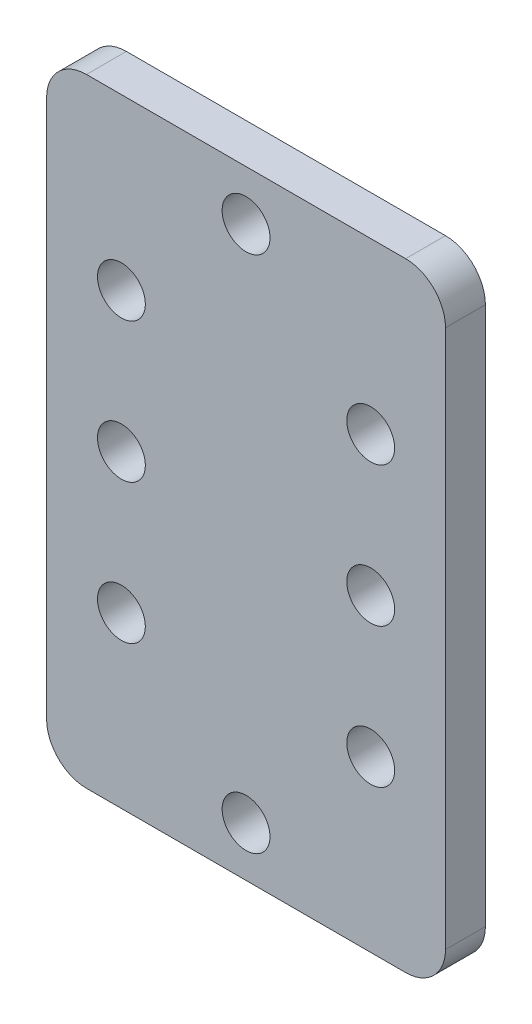
ISO-10303-21;
HEADER;
FILE_DESCRIPTION(('STEP AP214'),'2;1');
FILE_NAME('part.step','',(''),(''),'','','');
FILE_SCHEMA(('AUTOMOTIVE_DESIGN { 1 0 10303 214 1 1 1 1 }'));
ENDSEC;
DATA;
#1=APPLICATION_CONTEXT('core data for automotive mechanical design processes');
#2=APPLICATION_PROTOCOL_DEFINITION('international standard','automotive_design',2000,#1);
#3=PRODUCT_CONTEXT('',#1,'mechanical');
#4=PRODUCT('Part','Part','',(#3));
#5=PRODUCT_RELATED_PRODUCT_CATEGORY('part','',(#4));
#6=PRODUCT_DEFINITION_FORMATION('','',#4);
#7=PRODUCT_DEFINITION_CONTEXT('part definition',#1,'design');
#8=PRODUCT_DEFINITION('design','',#6,#7);
#9=PRODUCT_DEFINITION_SHAPE('','',#8);
#10=(LENGTH_UNIT() NAMED_UNIT(*) SI_UNIT(.MILLI.,.METRE.));
#11=(NAMED_UNIT(*) PLANE_ANGLE_UNIT() SI_UNIT($,.RADIAN.));
#12=(NAMED_UNIT(*) SI_UNIT($,.STERADIAN.) SOLID_ANGLE_UNIT());
#13=UNCERTAINTY_MEASURE_WITH_UNIT(LENGTH_MEASURE(1.E-05),#10,'distance_accuracy_value','');
#14=(GEOMETRIC_REPRESENTATION_CONTEXT(3) GLOBAL_UNCERTAINTY_ASSIGNED_CONTEXT((#13)) GLOBAL_UNIT_ASSIGNED_CONTEXT((#10,
#11,#12)) REPRESENTATION_CONTEXT('',''));
#15=CARTESIAN_POINT('',(0.,0.,0.));
#16=DIRECTION('',(0.,0.,1.));
#17=DIRECTION('',(1.,0.,0.));
#18=AXIS2_PLACEMENT_3D('',#15,#16,#17);
#19=CARTESIAN_POINT('',(0.,0.,2.54));
#20=DIRECTION('',(0.,0.,1.));
#21=DIRECTION('',(1.,0.,0.));
#22=AXIS2_PLACEMENT_3D('',#19,#20,#21);
#23=PLANE('',#22);
#24=CARTESIAN_POINT('',(12.7,-3.175,2.54));
#25=DIRECTION('',(0.,0.,1.));
#26=DIRECTION('',(1.,0.,0.));
#27=AXIS2_PLACEMENT_3D('',#24,#25,#26);
#28=CIRCLE('',#27,1.524);
#29=CARTESIAN_POINT('',(14.224,-3.175,2.54));
#30=VERTEX_POINT('',#29);
#31=EDGE_CURVE('E215',#30,#30,#28,.T.);
#32=ORIENTED_EDGE('',*,*,#31,.F.);
#33=EDGE_LOOP('',(#32));
#34=FACE_BOUND('',#33,.T.);
#35=CARTESIAN_POINT('',(4.76250000000009,-28.575,2.54));
#36=DIRECTION('',(0.,0.,1.));
#37=DIRECTION('',(1.,0.,0.));
#38=AXIS2_PLACEMENT_3D('',#35,#36,#37);
#39=CIRCLE('',#38,1.524);
#40=CARTESIAN_POINT('',(6.28650000000009,-28.575,2.54));
#41=VERTEX_POINT('',#40);
#42=EDGE_CURVE('E203',#41,#41,#39,.T.);
#43=ORIENTED_EDGE('',*,*,#42,.F.);
#44=EDGE_LOOP('',(#43));
#45=FACE_BOUND('',#44,.T.);
#46=CARTESIAN_POINT('',(4.76249999999997,-10.795,2.54));
#47=DIRECTION('',(0.,0.,1.));
#48=DIRECTION('',(1.,0.,0.));
#49=AXIS2_PLACEMENT_3D('',#46,#47,#48);
#50=CIRCLE('',#49,1.524);
#51=CARTESIAN_POINT('',(6.28649999999997,-10.795,2.54));
#52=VERTEX_POINT('',#51);
#53=EDGE_CURVE('E191',#52,#52,#50,.T.);
#54=ORIENTED_EDGE('',*,*,#53,.F.);
#55=EDGE_LOOP('',(#54));
#56=FACE_BOUND('',#55,.T.);
#57=CARTESIAN_POINT('',(4.7625,-19.685,2.54));
#58=DIRECTION('',(0.,0.,1.));
#59=DIRECTION('',(1.,0.,0.));
#60=AXIS2_PLACEMENT_3D('',#57,#58,#59);
#61=CIRCLE('',#60,1.524);
#62=CARTESIAN_POINT('',(6.2865,-19.685,2.54));
#63=VERTEX_POINT('',#62);
#64=EDGE_CURVE('E174',#63,#63,#61,.T.);
#65=ORIENTED_EDGE('',*,*,#64,.F.);
#66=EDGE_LOOP('',(#65));
#67=FACE_BOUND('',#66,.T.);
#68=DIRECTION('',(1.,0.,0.));
#69=VECTOR('',#68,1.);
#70=CARTESIAN_POINT('',(0.,-39.37,2.54));
#71=LINE('',#70,#69);
#72=CARTESIAN_POINT('',(2.54000000000001,-39.37,2.54));
#73=VERTEX_POINT('',#72);
#74=CARTESIAN_POINT('',(22.86,-39.37,2.54));
#75=VERTEX_POINT('',#74);
#76=EDGE_CURVE('E181',#73,#75,#71,.T.);
#77=ORIENTED_EDGE('',*,*,#76,.T.);
#78=CARTESIAN_POINT('',(22.86,-36.83,2.54));
#79=DIRECTION('',(0.,0.,1.));
#80=DIRECTION('',(1.,0.,0.));
#81=AXIS2_PLACEMENT_3D('',#78,#79,#80);
#82=CIRCLE('',#81,2.54);
#83=CARTESIAN_POINT('',(25.4,-36.83,2.54));
#84=VERTEX_POINT('',#83);
#85=EDGE_CURVE('E158',#75,#84,#82,.T.);
#86=ORIENTED_EDGE('',*,*,#85,.T.);
#87=DIRECTION('',(0.,1.,0.));
#88=VECTOR('',#87,1.);
#89=CARTESIAN_POINT('',(25.4,0.,2.54));
#90=LINE('',#89,#88);
#91=CARTESIAN_POINT('',(25.4,-2.54,2.54));
#92=VERTEX_POINT('',#91);
#93=EDGE_CURVE('E128',#84,#92,#90,.T.);
#94=ORIENTED_EDGE('',*,*,#93,.T.);
#95=CARTESIAN_POINT('',(22.86,-2.54,2.54));
#96=DIRECTION('',(0.,0.,1.));
#97=DIRECTION('',(1.,0.,0.));
#98=AXIS2_PLACEMENT_3D('',#95,#96,#97);
#99=CIRCLE('',#98,2.54);
#100=CARTESIAN_POINT('',(22.86,0.,2.54));
#101=VERTEX_POINT('',#100);
#102=EDGE_CURVE('E65',#92,#101,#99,.T.);
#103=ORIENTED_EDGE('',*,*,#102,.T.);
#104=DIRECTION('',(-1.,0.,0.));
#105=VECTOR('',#104,1.);
#106=CARTESIAN_POINT('',(0.,0.,2.54));
#107=LINE('',#106,#105);
#108=CARTESIAN_POINT('',(2.54,0.,2.54));
#109=VERTEX_POINT('',#108);
#110=EDGE_CURVE('E144',#101,#109,#107,.T.);
#111=ORIENTED_EDGE('',*,*,#110,.T.);
#112=CARTESIAN_POINT('',(2.54,-2.54,2.54));
#113=DIRECTION('',(0.,0.,1.));
#114=DIRECTION('',(1.,0.,0.));
#115=AXIS2_PLACEMENT_3D('',#112,#113,#114);
#116=CIRCLE('',#115,2.54);
#117=CARTESIAN_POINT('',(0.,-2.54,2.54));
#118=VERTEX_POINT('',#117);
#119=EDGE_CURVE('E153',#109,#118,#116,.T.);
#120=ORIENTED_EDGE('',*,*,#119,.T.);
#121=DIRECTION('',(0.,-1.,0.));
#122=VECTOR('',#121,1.);
#123=CARTESIAN_POINT('',(0.,0.,2.54));
#124=LINE('',#123,#122);
#125=CARTESIAN_POINT('',(0.,-36.83,2.54));
#126=VERTEX_POINT('',#125);
#127=EDGE_CURVE('E138',#118,#126,#124,.T.);
#128=ORIENTED_EDGE('',*,*,#127,.T.);
#129=CARTESIAN_POINT('',(2.54000000000001,-36.83,2.54));
#130=DIRECTION('',(0.,0.,1.));
#131=DIRECTION('',(1.,0.,0.));
#132=AXIS2_PLACEMENT_3D('',#129,#130,#131);
#133=CIRCLE('',#132,2.54);
#134=EDGE_CURVE('E155',#126,#73,#133,.T.);
#135=ORIENTED_EDGE('',*,*,#134,.T.);
#136=EDGE_LOOP('',(#77,#86,#94,#103,#111,#120,#128,#135));
#137=FACE_BOUND('',#136,.T.);
#138=CARTESIAN_POINT('',(20.6375,-19.685,2.54));
#139=DIRECTION('',(0.,0.,1.));
#140=DIRECTION('',(-1.,0.,0.));
#141=AXIS2_PLACEMENT_3D('',#138,#139,#140);
#142=CIRCLE('',#141,1.524);
#143=CARTESIAN_POINT('',(19.1135,-19.685,2.54));
#144=VERTEX_POINT('',#143);
#145=EDGE_CURVE('E186',#144,#144,#142,.T.);
#146=ORIENTED_EDGE('',*,*,#145,.F.);
#147=EDGE_LOOP('',(#146));
#148=FACE_BOUND('',#147,.T.);
#149=CARTESIAN_POINT('',(20.6375,-10.795,2.54));
#150=DIRECTION('',(0.,0.,1.));
#151=DIRECTION('',(-1.,0.,0.));
#152=AXIS2_PLACEMENT_3D('',#149,#150,#151);
#153=CIRCLE('',#152,1.524);
#154=CARTESIAN_POINT('',(19.1135,-10.795,2.54));
#155=VERTEX_POINT('',#154);
#156=EDGE_CURVE('E197',#155,#155,#153,.T.);
#157=ORIENTED_EDGE('',*,*,#156,.F.);
#158=EDGE_LOOP('',(#157));
#159=FACE_BOUND('',#158,.T.);
#160=CARTESIAN_POINT('',(20.6375000000001,-28.575,2.54));
#161=DIRECTION('',(0.,0.,1.));
#162=DIRECTION('',(-1.,0.,0.));
#163=AXIS2_PLACEMENT_3D('',#160,#161,#162);
#164=CIRCLE('',#163,1.524);
#165=CARTESIAN_POINT('',(19.1135000000001,-28.575,2.54));
#166=VERTEX_POINT('',#165);
#167=EDGE_CURVE('E209',#166,#166,#164,.T.);
#168=ORIENTED_EDGE('',*,*,#167,.F.);
#169=EDGE_LOOP('',(#168));
#170=FACE_BOUND('',#169,.T.);
#171=CARTESIAN_POINT('',(12.7,-36.195,2.54));
#172=DIRECTION('',(0.,0.,1.));
#173=DIRECTION('',(1.,0.,0.));
#174=AXIS2_PLACEMENT_3D('',#171,#172,#173);
#175=CIRCLE('',#174,1.524);
#176=CARTESIAN_POINT('',(14.224,-36.195,2.54));
#177=VERTEX_POINT('',#176);
#178=EDGE_CURVE('E221',#177,#177,#175,.T.);
#179=ORIENTED_EDGE('',*,*,#178,.F.);
#180=EDGE_LOOP('',(#179));
#181=FACE_BOUND('',#180,.T.);
#182=ADVANCED_FACE('F43',(#34,#45,#56,#67,#137,#148,#159,#170,#181),#23,.T.);
#183=CARTESIAN_POINT('',(0.,0.,0.));
#184=DIRECTION('',(0.,0.,1.));
#185=DIRECTION('',(1.,0.,0.));
#186=AXIS2_PLACEMENT_3D('',#183,#184,#185);
#187=PLANE('',#186);
#188=DIRECTION('',(0.,1.,0.));
#189=VECTOR('',#188,1.);
#190=CARTESIAN_POINT('',(25.4,0.,0.));
#191=LINE('',#190,#189);
#192=CARTESIAN_POINT('',(25.4,-36.83,0.));
#193=VERTEX_POINT('',#192);
#194=CARTESIAN_POINT('',(25.4,-2.54,0.));
#195=VERTEX_POINT('',#194);
#196=EDGE_CURVE('E126',#193,#195,#191,.T.);
#197=ORIENTED_EDGE('',*,*,#196,.F.);
#198=CARTESIAN_POINT('',(22.86,-36.83,0.));
#199=DIRECTION('',(0.,0.,1.));
#200=DIRECTION('',(1.,0.,0.));
#201=AXIS2_PLACEMENT_3D('',#198,#199,#200);
#202=CIRCLE('',#201,2.54);
#203=CARTESIAN_POINT('',(22.86,-39.37,0.));
#204=VERTEX_POINT('',#203);
#205=EDGE_CURVE('E109',#193,#204,#202,.F.);
#206=ORIENTED_EDGE('',*,*,#205,.T.);
#207=DIRECTION('',(1.,0.,0.));
#208=VECTOR('',#207,1.);
#209=CARTESIAN_POINT('',(0.,-39.37,0.));
#210=LINE('',#209,#208);
#211=CARTESIAN_POINT('',(2.54000000000001,-39.37,0.));
#212=VERTEX_POINT('',#211);
#213=EDGE_CURVE('E136',#212,#204,#210,.T.);
#214=ORIENTED_EDGE('',*,*,#213,.F.);
#215=CARTESIAN_POINT('',(2.54000000000001,-36.83,0.));
#216=DIRECTION('',(0.,0.,1.));
#217=DIRECTION('',(1.,0.,0.));
#218=AXIS2_PLACEMENT_3D('',#215,#216,#217);
#219=CIRCLE('',#218,2.54);
#220=CARTESIAN_POINT('',(0.,-36.83,0.));
#221=VERTEX_POINT('',#220);
#222=EDGE_CURVE('E147',#212,#221,#219,.F.);
#223=ORIENTED_EDGE('',*,*,#222,.T.);
#224=DIRECTION('',(0.,-1.,0.));
#225=VECTOR('',#224,1.);
#226=CARTESIAN_POINT('',(0.,0.,0.));
#227=LINE('',#226,#225);
#228=CARTESIAN_POINT('',(0.,-2.54,0.));
#229=VERTEX_POINT('',#228);
#230=EDGE_CURVE('E140',#229,#221,#227,.T.);
#231=ORIENTED_EDGE('',*,*,#230,.F.);
#232=CARTESIAN_POINT('',(2.54,-2.54,0.));
#233=DIRECTION('',(0.,0.,1.));
#234=DIRECTION('',(1.,0.,0.));
#235=AXIS2_PLACEMENT_3D('',#232,#233,#234);
#236=CIRCLE('',#235,2.54);
#237=CARTESIAN_POINT('',(2.54,0.,0.));
#238=VERTEX_POINT('',#237);
#239=EDGE_CURVE('E129',#229,#238,#236,.F.);
#240=ORIENTED_EDGE('',*,*,#239,.T.);
#241=DIRECTION('',(-1.,0.,0.));
#242=VECTOR('',#241,1.);
#243=CARTESIAN_POINT('',(0.,0.,0.));
#244=LINE('',#243,#242);
#245=CARTESIAN_POINT('',(22.86,0.,0.));
#246=VERTEX_POINT('',#245);
#247=EDGE_CURVE('E135',#246,#238,#244,.T.);
#248=ORIENTED_EDGE('',*,*,#247,.F.);
#249=CARTESIAN_POINT('',(22.86,-2.54,0.));
#250=DIRECTION('',(0.,0.,1.));
#251=DIRECTION('',(1.,0.,0.));
#252=AXIS2_PLACEMENT_3D('',#249,#250,#251);
#253=CIRCLE('',#252,2.54);
#254=EDGE_CURVE('E120',#246,#195,#253,.F.);
#255=ORIENTED_EDGE('',*,*,#254,.T.);
#256=EDGE_LOOP('',(#197,#206,#214,#223,#231,#240,#248,#255));
#257=FACE_BOUND('',#256,.T.);
#258=CARTESIAN_POINT('',(4.7625,-19.685,0.));
#259=DIRECTION('',(0.,0.,1.));
#260=DIRECTION('',(1.,0.,0.));
#261=AXIS2_PLACEMENT_3D('',#258,#259,#260);
#262=CIRCLE('',#261,1.524);
#263=CARTESIAN_POINT('',(6.2865,-19.685,0.));
#264=VERTEX_POINT('',#263);
#265=EDGE_CURVE('E176',#264,#264,#262,.T.);
#266=ORIENTED_EDGE('',*,*,#265,.T.);
#267=EDGE_LOOP('',(#266));
#268=FACE_BOUND('',#267,.T.);
#269=CARTESIAN_POINT('',(20.6375,-19.685,0.));
#270=DIRECTION('',(0.,0.,1.));
#271=DIRECTION('',(-1.,0.,0.));
#272=AXIS2_PLACEMENT_3D('',#269,#270,#271);
#273=CIRCLE('',#272,1.524);
#274=CARTESIAN_POINT('',(19.1135,-19.685,0.));
#275=VERTEX_POINT('',#274);
#276=EDGE_CURVE('E188',#275,#275,#273,.T.);
#277=ORIENTED_EDGE('',*,*,#276,.T.);
#278=EDGE_LOOP('',(#277));
#279=FACE_BOUND('',#278,.T.);
#280=CARTESIAN_POINT('',(4.76249999999997,-10.795,0.));
#281=DIRECTION('',(0.,0.,1.));
#282=DIRECTION('',(1.,0.,0.));
#283=AXIS2_PLACEMENT_3D('',#280,#281,#282);
#284=CIRCLE('',#283,1.524);
#285=CARTESIAN_POINT('',(6.28649999999997,-10.795,0.));
#286=VERTEX_POINT('',#285);
#287=EDGE_CURVE('E194',#286,#286,#284,.T.);
#288=ORIENTED_EDGE('',*,*,#287,.T.);
#289=EDGE_LOOP('',(#288));
#290=FACE_BOUND('',#289,.T.);
#291=CARTESIAN_POINT('',(20.6375,-10.795,0.));
#292=DIRECTION('',(0.,0.,1.));
#293=DIRECTION('',(-1.,0.,0.));
#294=AXIS2_PLACEMENT_3D('',#291,#292,#293);
#295=CIRCLE('',#294,1.524);
#296=CARTESIAN_POINT('',(19.1135,-10.795,0.));
#297=VERTEX_POINT('',#296);
#298=EDGE_CURVE('E200',#297,#297,#295,.T.);
#299=ORIENTED_EDGE('',*,*,#298,.T.);
#300=EDGE_LOOP('',(#299));
#301=FACE_BOUND('',#300,.T.);
#302=CARTESIAN_POINT('',(4.76250000000009,-28.575,0.));
#303=DIRECTION('',(0.,0.,1.));
#304=DIRECTION('',(1.,0.,0.));
#305=AXIS2_PLACEMENT_3D('',#302,#303,#304);
#306=CIRCLE('',#305,1.524);
#307=CARTESIAN_POINT('',(6.28650000000009,-28.575,0.));
#308=VERTEX_POINT('',#307);
#309=EDGE_CURVE('E206',#308,#308,#306,.T.);
#310=ORIENTED_EDGE('',*,*,#309,.T.);
#311=EDGE_LOOP('',(#310));
#312=FACE_BOUND('',#311,.T.);
#313=CARTESIAN_POINT('',(20.6375000000001,-28.575,0.));
#314=DIRECTION('',(0.,0.,1.));
#315=DIRECTION('',(-1.,0.,0.));
#316=AXIS2_PLACEMENT_3D('',#313,#314,#315);
#317=CIRCLE('',#316,1.524);
#318=CARTESIAN_POINT('',(19.1135000000001,-28.575,0.));
#319=VERTEX_POINT('',#318);
#320=EDGE_CURVE('E212',#319,#319,#317,.T.);
#321=ORIENTED_EDGE('',*,*,#320,.T.);
#322=EDGE_LOOP('',(#321));
#323=FACE_BOUND('',#322,.T.);
#324=CARTESIAN_POINT('',(12.7,-3.175,0.));
#325=DIRECTION('',(0.,0.,1.));
#326=DIRECTION('',(1.,0.,0.));
#327=AXIS2_PLACEMENT_3D('',#324,#325,#326);
#328=CIRCLE('',#327,1.524);
#329=CARTESIAN_POINT('',(14.224,-3.175,0.));
#330=VERTEX_POINT('',#329);
#331=EDGE_CURVE('E218',#330,#330,#328,.T.);
#332=ORIENTED_EDGE('',*,*,#331,.T.);
#333=EDGE_LOOP('',(#332));
#334=FACE_BOUND('',#333,.T.);
#335=CARTESIAN_POINT('',(12.7,-36.195,0.));
#336=DIRECTION('',(0.,0.,1.));
#337=DIRECTION('',(1.,0.,0.));
#338=AXIS2_PLACEMENT_3D('',#335,#336,#337);
#339=CIRCLE('',#338,1.524);
#340=CARTESIAN_POINT('',(14.224,-36.195,0.));
#341=VERTEX_POINT('',#340);
#342=EDGE_CURVE('E224',#341,#341,#339,.T.);
#343=ORIENTED_EDGE('',*,*,#342,.T.);
#344=EDGE_LOOP('',(#343));
#345=FACE_BOUND('',#344,.T.);
#346=ADVANCED_FACE('F132',(#257,#268,#279,#290,#301,#312,#323,#334,#345),#187,.F.);
#347=CARTESIAN_POINT('',(0.,0.,2.54));
#348=DIRECTION('',(1.,0.,0.));
#349=DIRECTION('',(0.,1.,0.));
#350=AXIS2_PLACEMENT_3D('',#347,#348,#349);
#351=PLANE('',#350);
#352=ORIENTED_EDGE('',*,*,#230,.T.);
#353=DIRECTION('',(0.,0.,-1.));
#354=VECTOR('',#353,1.);
#355=CARTESIAN_POINT('',(0.,-36.83,2.54));
#356=LINE('',#355,#354);
#357=EDGE_CURVE('E11',#221,#126,#356,.F.);
#358=ORIENTED_EDGE('',*,*,#357,.T.);
#359=ORIENTED_EDGE('',*,*,#127,.F.);
#360=DIRECTION('',(0.,0.,-1.));
#361=VECTOR('',#360,1.);
#362=CARTESIAN_POINT('',(0.,-2.54,2.54));
#363=LINE('',#362,#361);
#364=EDGE_CURVE('E51',#118,#229,#363,.T.);
#365=ORIENTED_EDGE('',*,*,#364,.T.);
#366=EDGE_LOOP('',(#352,#358,#359,#365));
#367=FACE_BOUND('',#366,.T.);
#368=ADVANCED_FACE('F169',(#367),#351,.F.);
#369=CARTESIAN_POINT('',(0.,-39.37,2.54));
#370=DIRECTION('',(0.,1.,0.));
#371=DIRECTION('',(0.,0.,1.));
#372=AXIS2_PLACEMENT_3D('',#369,#370,#371);
#373=PLANE('',#372);
#374=ORIENTED_EDGE('',*,*,#213,.T.);
#375=DIRECTION('',(0.,0.,-1.));
#376=VECTOR('',#375,1.);
#377=CARTESIAN_POINT('',(22.86,-39.37,2.54));
#378=LINE('',#377,#376);
#379=EDGE_CURVE('E114',#204,#75,#378,.F.);
#380=ORIENTED_EDGE('',*,*,#379,.T.);
#381=ORIENTED_EDGE('',*,*,#76,.F.);
#382=DIRECTION('',(0.,0.,-1.));
#383=VECTOR('',#382,1.);
#384=CARTESIAN_POINT('',(2.54000000000001,-39.37,2.54));
#385=LINE('',#384,#383);
#386=EDGE_CURVE('E119',#73,#212,#385,.T.);
#387=ORIENTED_EDGE('',*,*,#386,.T.);
#388=EDGE_LOOP('',(#374,#380,#381,#387));
#389=FACE_BOUND('',#388,.T.);
#390=ADVANCED_FACE('F252',(#389),#373,.F.);
#391=CARTESIAN_POINT('',(25.4,0.,2.54));
#392=DIRECTION('',(-1.,0.,0.));
#393=DIRECTION('',(0.,0.,1.));
#394=AXIS2_PLACEMENT_3D('',#391,#392,#393);
#395=PLANE('',#394);
#396=ORIENTED_EDGE('',*,*,#93,.F.);
#397=DIRECTION('',(0.,0.,-1.));
#398=VECTOR('',#397,1.);
#399=CARTESIAN_POINT('',(25.4,-36.83,2.54));
#400=LINE('',#399,#398);
#401=EDGE_CURVE('E113',#84,#193,#400,.T.);
#402=ORIENTED_EDGE('',*,*,#401,.T.);
#403=ORIENTED_EDGE('',*,*,#196,.T.);
#404=DIRECTION('',(0.,0.,-1.));
#405=VECTOR('',#404,1.);
#406=CARTESIAN_POINT('',(25.4,-2.54,2.54));
#407=LINE('',#406,#405);
#408=EDGE_CURVE('E130',#195,#92,#407,.F.);
#409=ORIENTED_EDGE('',*,*,#408,.T.);
#410=EDGE_LOOP('',(#396,#402,#403,#409));
#411=FACE_BOUND('',#410,.T.);
#412=ADVANCED_FACE('F125',(#411),#395,.F.);
#413=CARTESIAN_POINT('',(0.,0.,2.54));
#414=DIRECTION('',(0.,-1.,0.));
#415=DIRECTION('',(0.,0.,-1.));
#416=AXIS2_PLACEMENT_3D('',#413,#414,#415);
#417=PLANE('',#416);
#418=ORIENTED_EDGE('',*,*,#110,.F.);
#419=DIRECTION('',(0.,0.,-1.));
#420=VECTOR('',#419,1.);
#421=CARTESIAN_POINT('',(22.86,0.,2.54));
#422=LINE('',#421,#420);
#423=EDGE_CURVE('E161',#101,#246,#422,.T.);
#424=ORIENTED_EDGE('',*,*,#423,.T.);
#425=ORIENTED_EDGE('',*,*,#247,.T.);
#426=DIRECTION('',(0.,0.,-1.));
#427=VECTOR('',#426,1.);
#428=CARTESIAN_POINT('',(2.54,0.,2.54));
#429=LINE('',#428,#427);
#430=EDGE_CURVE('E58',#238,#109,#429,.F.);
#431=ORIENTED_EDGE('',*,*,#430,.T.);
#432=EDGE_LOOP('',(#418,#424,#425,#431));
#433=FACE_BOUND('',#432,.T.);
#434=ADVANCED_FACE('F247',(#433),#417,.F.);
#435=CARTESIAN_POINT('',(4.7625,-19.685,2.54));
#436=DIRECTION('',(0.,0.,-1.));
#437=DIRECTION('',(-1.,0.,0.));
#438=AXIS2_PLACEMENT_3D('',#435,#436,#437);
#439=CYLINDRICAL_SURFACE('',#438,1.524);
#440=ORIENTED_EDGE('',*,*,#64,.T.);
#441=EDGE_LOOP('',(#440));
#442=FACE_BOUND('',#441,.T.);
#443=ORIENTED_EDGE('',*,*,#265,.F.);
#444=EDGE_LOOP('',(#443));
#445=FACE_BOUND('',#444,.T.);
#446=ADVANCED_FACE('F244',(#442,#445),#439,.F.);
#447=CARTESIAN_POINT('',(20.6375,-19.685,2.54));
#448=DIRECTION('',(0.,0.,-1.));
#449=DIRECTION('',(-1.,0.,0.));
#450=AXIS2_PLACEMENT_3D('',#447,#448,#449);
#451=CYLINDRICAL_SURFACE('',#450,1.524);
#452=ORIENTED_EDGE('',*,*,#145,.T.);
#453=EDGE_LOOP('',(#452));
#454=FACE_BOUND('',#453,.T.);
#455=ORIENTED_EDGE('',*,*,#276,.F.);
#456=EDGE_LOOP('',(#455));
#457=FACE_BOUND('',#456,.T.);
#458=ADVANCED_FACE('F308',(#454,#457),#451,.F.);
#459=CARTESIAN_POINT('',(4.76249999999997,-10.795,2.54));
#460=DIRECTION('',(0.,0.,-1.));
#461=DIRECTION('',(-1.,0.,0.));
#462=AXIS2_PLACEMENT_3D('',#459,#460,#461);
#463=CYLINDRICAL_SURFACE('',#462,1.524);
#464=ORIENTED_EDGE('',*,*,#53,.T.);
#465=EDGE_LOOP('',(#464));
#466=FACE_BOUND('',#465,.T.);
#467=ORIENTED_EDGE('',*,*,#287,.F.);
#468=EDGE_LOOP('',(#467));
#469=FACE_BOUND('',#468,.T.);
#470=ADVANCED_FACE('F305',(#466,#469),#463,.F.);
#471=CARTESIAN_POINT('',(20.6375,-10.795,2.54));
#472=DIRECTION('',(0.,0.,-1.));
#473=DIRECTION('',(-1.,0.,0.));
#474=AXIS2_PLACEMENT_3D('',#471,#472,#473);
#475=CYLINDRICAL_SURFACE('',#474,1.524);
#476=ORIENTED_EDGE('',*,*,#156,.T.);
#477=EDGE_LOOP('',(#476));
#478=FACE_BOUND('',#477,.T.);
#479=ORIENTED_EDGE('',*,*,#298,.F.);
#480=EDGE_LOOP('',(#479));
#481=FACE_BOUND('',#480,.T.);
#482=ADVANCED_FACE('F301',(#478,#481),#475,.F.);
#483=CARTESIAN_POINT('',(4.76250000000009,-28.575,2.54));
#484=DIRECTION('',(0.,0.,-1.));
#485=DIRECTION('',(-1.,0.,0.));
#486=AXIS2_PLACEMENT_3D('',#483,#484,#485);
#487=CYLINDRICAL_SURFACE('',#486,1.524);
#488=ORIENTED_EDGE('',*,*,#42,.T.);
#489=EDGE_LOOP('',(#488));
#490=FACE_BOUND('',#489,.T.);
#491=ORIENTED_EDGE('',*,*,#309,.F.);
#492=EDGE_LOOP('',(#491));
#493=FACE_BOUND('',#492,.T.);
#494=ADVANCED_FACE('F284',(#490,#493),#487,.F.);
#495=CARTESIAN_POINT('',(20.6375000000001,-28.575,2.54));
#496=DIRECTION('',(0.,0.,-1.));
#497=DIRECTION('',(-1.,0.,0.));
#498=AXIS2_PLACEMENT_3D('',#495,#496,#497);
#499=CYLINDRICAL_SURFACE('',#498,1.524);
#500=ORIENTED_EDGE('',*,*,#167,.T.);
#501=EDGE_LOOP('',(#500));
#502=FACE_BOUND('',#501,.T.);
#503=ORIENTED_EDGE('',*,*,#320,.F.);
#504=EDGE_LOOP('',(#503));
#505=FACE_BOUND('',#504,.T.);
#506=ADVANCED_FACE('F280',(#502,#505),#499,.F.);
#507=CARTESIAN_POINT('',(12.7,-3.175,2.54));
#508=DIRECTION('',(0.,0.,-1.));
#509=DIRECTION('',(-1.,0.,0.));
#510=AXIS2_PLACEMENT_3D('',#507,#508,#509);
#511=CYLINDRICAL_SURFACE('',#510,1.524);
#512=ORIENTED_EDGE('',*,*,#31,.T.);
#513=EDGE_LOOP('',(#512));
#514=FACE_BOUND('',#513,.T.);
#515=ORIENTED_EDGE('',*,*,#331,.F.);
#516=EDGE_LOOP('',(#515));
#517=FACE_BOUND('',#516,.T.);
#518=ADVANCED_FACE('F283',(#514,#517),#511,.F.);
#519=CARTESIAN_POINT('',(12.7,-36.195,2.54));
#520=DIRECTION('',(0.,0.,-1.));
#521=DIRECTION('',(-1.,0.,0.));
#522=AXIS2_PLACEMENT_3D('',#519,#520,#521);
#523=CYLINDRICAL_SURFACE('',#522,1.524);
#524=ORIENTED_EDGE('',*,*,#178,.T.);
#525=EDGE_LOOP('',(#524));
#526=FACE_BOUND('',#525,.T.);
#527=ORIENTED_EDGE('',*,*,#342,.F.);
#528=EDGE_LOOP('',(#527));
#529=FACE_BOUND('',#528,.T.);
#530=ADVANCED_FACE('F230',(#526,#529),#523,.F.);
#531=CARTESIAN_POINT('',(22.86,-36.83,2.54));
#532=DIRECTION('',(0.,0.,-1.));
#533=DIRECTION('',(-1.,0.,0.));
#534=AXIS2_PLACEMENT_3D('',#531,#532,#533);
#535=CYLINDRICAL_SURFACE('',#534,2.54);
#536=ORIENTED_EDGE('',*,*,#85,.F.);
#537=ORIENTED_EDGE('',*,*,#379,.F.);
#538=ORIENTED_EDGE('',*,*,#205,.F.);
#539=ORIENTED_EDGE('',*,*,#401,.F.);
#540=EDGE_LOOP('',(#536,#537,#538,#539));
#541=FACE_BOUND('',#540,.T.);
#542=ADVANCED_FACE('F112',(#541),#535,.T.);
#543=CARTESIAN_POINT('',(22.86,-2.54,2.54));
#544=DIRECTION('',(0.,0.,-1.));
#545=DIRECTION('',(-1.,0.,0.));
#546=AXIS2_PLACEMENT_3D('',#543,#544,#545);
#547=CYLINDRICAL_SURFACE('',#546,2.54);
#548=ORIENTED_EDGE('',*,*,#102,.F.);
#549=ORIENTED_EDGE('',*,*,#408,.F.);
#550=ORIENTED_EDGE('',*,*,#254,.F.);
#551=ORIENTED_EDGE('',*,*,#423,.F.);
#552=EDGE_LOOP('',(#548,#549,#550,#551));
#553=FACE_BOUND('',#552,.T.);
#554=ADVANCED_FACE('F260',(#553),#547,.T.);
#555=CARTESIAN_POINT('',(2.54000000000001,-36.83,2.54));
#556=DIRECTION('',(0.,0.,-1.));
#557=DIRECTION('',(-1.,0.,0.));
#558=AXIS2_PLACEMENT_3D('',#555,#556,#557);
#559=CYLINDRICAL_SURFACE('',#558,2.54);
#560=ORIENTED_EDGE('',*,*,#134,.F.);
#561=ORIENTED_EDGE('',*,*,#357,.F.);
#562=ORIENTED_EDGE('',*,*,#222,.F.);
#563=ORIENTED_EDGE('',*,*,#386,.F.);
#564=EDGE_LOOP('',(#560,#561,#562,#563));
#565=FACE_BOUND('',#564,.T.);
#566=ADVANCED_FACE('F262',(#565),#559,.T.);
#567=CARTESIAN_POINT('',(2.54,-2.54,2.54));
#568=DIRECTION('',(0.,0.,-1.));
#569=DIRECTION('',(-1.,0.,0.));
#570=AXIS2_PLACEMENT_3D('',#567,#568,#569);
#571=CYLINDRICAL_SURFACE('',#570,2.54);
#572=ORIENTED_EDGE('',*,*,#119,.F.);
#573=ORIENTED_EDGE('',*,*,#430,.F.);
#574=ORIENTED_EDGE('',*,*,#239,.F.);
#575=ORIENTED_EDGE('',*,*,#364,.F.);
#576=EDGE_LOOP('',(#572,#573,#574,#575));
#577=FACE_BOUND('',#576,.T.);
#578=ADVANCED_FACE('F45',(#577),#571,.T.);
#579=CLOSED_SHELL('',(#182,#346,#368,#390,#412,#434,#446,#458,#470,#482,#494,#506,#518,#530,
#542,#554,#566,#578));
#580=MANIFOLD_SOLID_BREP('B2',#579);
#581=ADVANCED_BREP_SHAPE_REPRESENTATION('',(#18,#580),#14);
#582=SHAPE_DEFINITION_REPRESENTATION(#9,#581);
ENDSEC;
END-ISO-10303-21;
